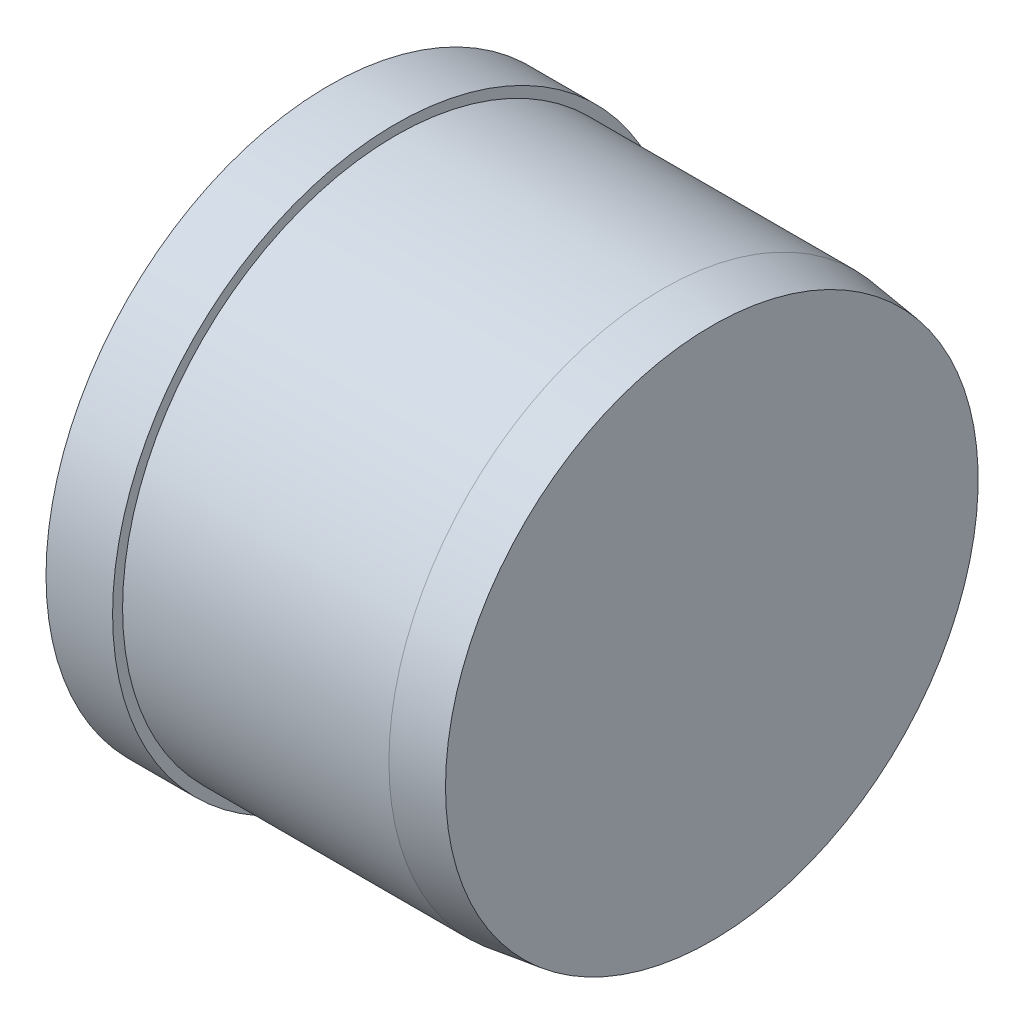
ISO-10303-21;
HEADER;
FILE_DESCRIPTION(('STEP AP214'),'2;1');
FILE_NAME('part.step','',(''),(''),'','','');
FILE_SCHEMA(('AUTOMOTIVE_DESIGN { 1 0 10303 214 1 1 1 1 }'));
ENDSEC;
DATA;
#1=APPLICATION_CONTEXT('core data for automotive mechanical design processes');
#2=APPLICATION_PROTOCOL_DEFINITION('international standard','automotive_design',2000,#1);
#3=PRODUCT_CONTEXT('',#1,'mechanical');
#4=PRODUCT('Part','Part','',(#3));
#5=PRODUCT_RELATED_PRODUCT_CATEGORY('part','',(#4));
#6=PRODUCT_DEFINITION_FORMATION('','',#4);
#7=PRODUCT_DEFINITION_CONTEXT('part definition',#1,'design');
#8=PRODUCT_DEFINITION('design','',#6,#7);
#9=PRODUCT_DEFINITION_SHAPE('','',#8);
#10=(LENGTH_UNIT() NAMED_UNIT(*) SI_UNIT(.MILLI.,.METRE.));
#11=(NAMED_UNIT(*) PLANE_ANGLE_UNIT() SI_UNIT($,.RADIAN.));
#12=(NAMED_UNIT(*) SI_UNIT($,.STERADIAN.) SOLID_ANGLE_UNIT());
#13=UNCERTAINTY_MEASURE_WITH_UNIT(LENGTH_MEASURE(1.E-05),#10,'distance_accuracy_value','');
#14=(GEOMETRIC_REPRESENTATION_CONTEXT(3) GLOBAL_UNCERTAINTY_ASSIGNED_CONTEXT((#13)) GLOBAL_UNIT_ASSIGNED_CONTEXT((#10,
#11,#12)) REPRESENTATION_CONTEXT('',''));
#15=CARTESIAN_POINT('',(0.,0.,0.));
#16=DIRECTION('',(0.,0.,1.));
#17=DIRECTION('',(1.,0.,0.));
#18=AXIS2_PLACEMENT_3D('',#15,#16,#17);
#19=CARTESIAN_POINT('',(57.5,0.,0.));
#20=DIRECTION('',(-1.,0.,0.));
#21=DIRECTION('',(0.,0.,1.));
#22=AXIS2_PLACEMENT_3D('',#19,#20,#21);
#23=PLANE('',#22);
#24=CARTESIAN_POINT('',(57.5,0.,0.));
#25=DIRECTION('',(-1.,0.,0.));
#26=DIRECTION('',(0.,0.,1.));
#27=AXIS2_PLACEMENT_3D('',#24,#25,#26);
#28=CIRCLE('',#27,40.);
#29=CARTESIAN_POINT('',(57.5,0.,40.));
#30=VERTEX_POINT('',#29);
#31=EDGE_CURVE('E10',#30,#30,#28,.T.);
#32=ORIENTED_EDGE('',*,*,#31,.F.);
#33=EDGE_LOOP('',(#32));
#34=FACE_BOUND('',#33,.T.);
#35=ADVANCED_FACE('F37',(#34),#23,.F.);
#36=CARTESIAN_POINT('',(57.5,0.,0.));
#37=DIRECTION('',(-1.,0.,0.));
#38=DIRECTION('',(0.,0.,1.));
#39=AXIS2_PLACEMENT_3D('',#36,#37,#38);
#40=CONICAL_SURFACE('',#39,40.,0.132551532296675);
#41=CARTESIAN_POINT('',(50.,0.,0.));
#42=DIRECTION('',(-1.,0.,0.));
#43=DIRECTION('',(0.,0.,1.));
#44=AXIS2_PLACEMENT_3D('',#41,#42,#43);
#45=CIRCLE('',#44,41.);
#46=CARTESIAN_POINT('',(50.,0.,41.));
#47=VERTEX_POINT('',#46);
#48=EDGE_CURVE('E44',#47,#47,#45,.T.);
#49=ORIENTED_EDGE('',*,*,#48,.F.);
#50=EDGE_LOOP('',(#49));
#51=FACE_BOUND('',#50,.T.);
#52=ORIENTED_EDGE('',*,*,#31,.T.);
#53=EDGE_LOOP('',(#52));
#54=FACE_BOUND('',#53,.T.);
#55=ADVANCED_FACE('F81',(#51,#54),#40,.T.);
#56=CARTESIAN_POINT('',(0.,0.,0.));
#57=DIRECTION('',(-1.,0.,0.));
#58=DIRECTION('',(0.,0.,1.));
#59=AXIS2_PLACEMENT_3D('',#56,#57,#58);
#60=CYLINDRICAL_SURFACE('',#59,41.);
#61=CARTESIAN_POINT('',(10.,0.,0.));
#62=DIRECTION('',(-1.,0.,0.));
#63=DIRECTION('',(0.,0.,1.));
#64=AXIS2_PLACEMENT_3D('',#61,#62,#63);
#65=CIRCLE('',#64,41.);
#66=CARTESIAN_POINT('',(10.,0.,41.));
#67=VERTEX_POINT('',#66);
#68=EDGE_CURVE('E49',#67,#67,#65,.T.);
#69=ORIENTED_EDGE('',*,*,#68,.F.);
#70=EDGE_LOOP('',(#69));
#71=FACE_BOUND('',#70,.T.);
#72=ORIENTED_EDGE('',*,*,#48,.T.);
#73=EDGE_LOOP('',(#72));
#74=FACE_BOUND('',#73,.T.);
#75=ADVANCED_FACE('F76',(#71,#74),#60,.T.);
#76=CARTESIAN_POINT('',(10.,41.,0.));
#77=DIRECTION('',(-1.,0.,0.));
#78=DIRECTION('',(0.,0.,1.));
#79=AXIS2_PLACEMENT_3D('',#76,#77,#78);
#80=PLANE('',#79);
#81=CARTESIAN_POINT('',(10.,0.,0.));
#82=DIRECTION('',(-1.,0.,0.));
#83=DIRECTION('',(0.,0.,1.));
#84=AXIS2_PLACEMENT_3D('',#81,#82,#83);
#85=CIRCLE('',#84,42.5);
#86=CARTESIAN_POINT('',(10.,0.,42.5));
#87=VERTEX_POINT('',#86);
#88=EDGE_CURVE('E54',#87,#87,#85,.T.);
#89=ORIENTED_EDGE('',*,*,#88,.F.);
#90=EDGE_LOOP('',(#89));
#91=FACE_BOUND('',#90,.T.);
#92=ORIENTED_EDGE('',*,*,#68,.T.);
#93=EDGE_LOOP('',(#92));
#94=FACE_BOUND('',#93,.T.);
#95=ADVANCED_FACE('F70',(#91,#94),#80,.F.);
#96=CARTESIAN_POINT('',(0.,0.,0.));
#97=DIRECTION('',(-1.,0.,0.));
#98=DIRECTION('',(0.,0.,1.));
#99=AXIS2_PLACEMENT_3D('',#96,#97,#98);
#100=CYLINDRICAL_SURFACE('',#99,42.5);
#101=CARTESIAN_POINT('',(0.,0.,0.));
#102=DIRECTION('',(-1.,0.,0.));
#103=DIRECTION('',(0.,0.,1.));
#104=AXIS2_PLACEMENT_3D('',#101,#102,#103);
#105=CIRCLE('',#104,42.5);
#106=CARTESIAN_POINT('',(0.,0.,42.5));
#107=VERTEX_POINT('',#106);
#108=EDGE_CURVE('E60',#107,#107,#105,.T.);
#109=ORIENTED_EDGE('',*,*,#108,.F.);
#110=EDGE_LOOP('',(#109));
#111=FACE_BOUND('',#110,.T.);
#112=ORIENTED_EDGE('',*,*,#88,.T.);
#113=EDGE_LOOP('',(#112));
#114=FACE_BOUND('',#113,.T.);
#115=ADVANCED_FACE('F67',(#111,#114),#100,.T.);
#116=CARTESIAN_POINT('',(0.,42.5,0.));
#117=DIRECTION('',(1.,0.,0.));
#118=DIRECTION('',(0.,0.,-1.));
#119=AXIS2_PLACEMENT_3D('',#116,#117,#118);
#120=PLANE('',#119);
#121=ORIENTED_EDGE('',*,*,#108,.T.);
#122=EDGE_LOOP('',(#121));
#123=FACE_BOUND('',#122,.T.);
#124=ADVANCED_FACE('F65',(#123),#120,.F.);
#125=CLOSED_SHELL('',(#35,#55,#75,#95,#115,#124));
#126=MANIFOLD_SOLID_BREP('B2',#125);
#127=ADVANCED_BREP_SHAPE_REPRESENTATION('',(#18,#126),#14);
#128=SHAPE_DEFINITION_REPRESENTATION(#9,#127);
ENDSEC;
END-ISO-10303-21;
